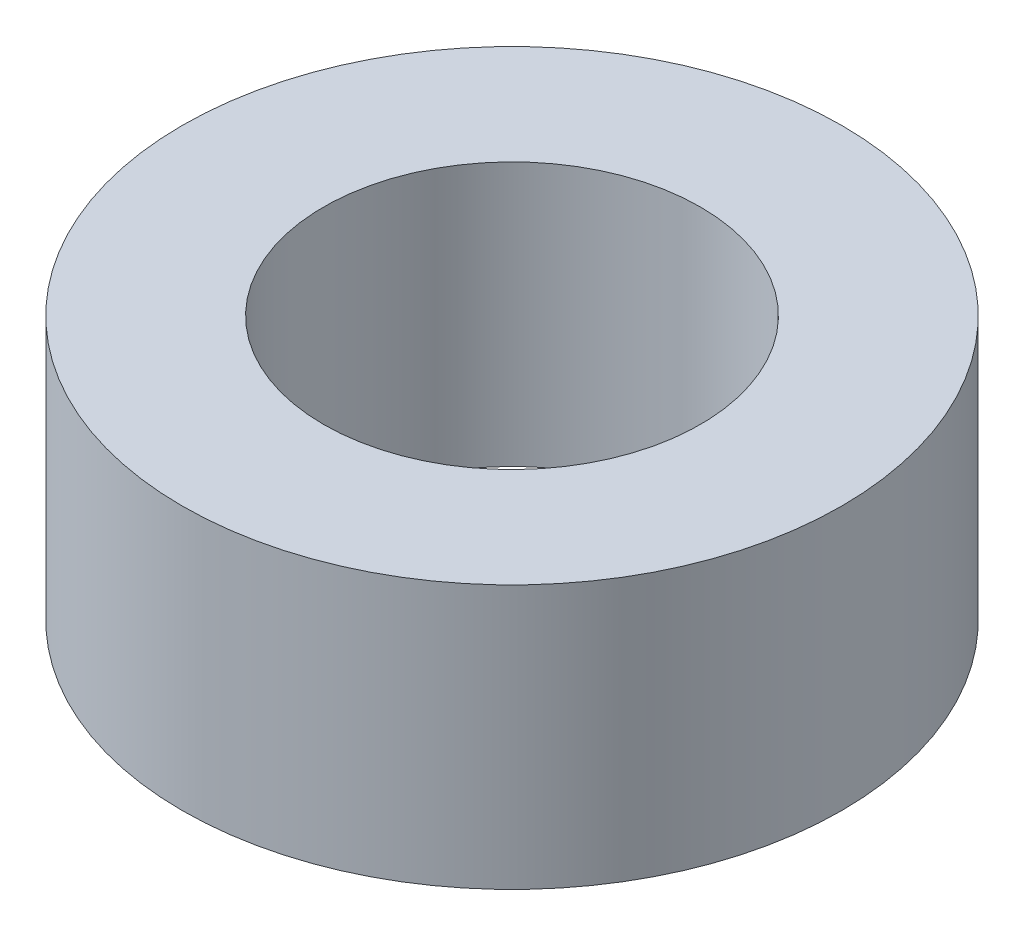
ISO-10303-21;
HEADER;
FILE_DESCRIPTION(('STEP AP214'),'2;1');
FILE_NAME('part.step','',(''),(''),'','','');
FILE_SCHEMA(('AUTOMOTIVE_DESIGN { 1 0 10303 214 1 1 1 1 }'));
ENDSEC;
DATA;
#1=APPLICATION_CONTEXT('core data for automotive mechanical design processes');
#2=APPLICATION_PROTOCOL_DEFINITION('international standard','automotive_design',2000,#1);
#3=PRODUCT_CONTEXT('',#1,'mechanical');
#4=PRODUCT('Part','Part','',(#3));
#5=PRODUCT_RELATED_PRODUCT_CATEGORY('part','',(#4));
#6=PRODUCT_DEFINITION_FORMATION('','',#4);
#7=PRODUCT_DEFINITION_CONTEXT('part definition',#1,'design');
#8=PRODUCT_DEFINITION('design','',#6,#7);
#9=PRODUCT_DEFINITION_SHAPE('','',#8);
#10=(LENGTH_UNIT() NAMED_UNIT(*) SI_UNIT(.MILLI.,.METRE.));
#11=(NAMED_UNIT(*) PLANE_ANGLE_UNIT() SI_UNIT($,.RADIAN.));
#12=(NAMED_UNIT(*) SI_UNIT($,.STERADIAN.) SOLID_ANGLE_UNIT());
#13=UNCERTAINTY_MEASURE_WITH_UNIT(LENGTH_MEASURE(1.E-05),#10,'distance_accuracy_value','');
#14=(GEOMETRIC_REPRESENTATION_CONTEXT(3) GLOBAL_UNCERTAINTY_ASSIGNED_CONTEXT((#13)) GLOBAL_UNIT_ASSIGNED_CONTEXT((#10,
#11,#12)) REPRESENTATION_CONTEXT('',''));
#15=CARTESIAN_POINT('',(0.,0.,0.));
#16=DIRECTION('',(0.,0.,1.));
#17=DIRECTION('',(1.,0.,0.));
#18=AXIS2_PLACEMENT_3D('',#15,#16,#17);
#19=CARTESIAN_POINT('',(0.,14.,0.));
#20=DIRECTION('',(0.,-1.,0.));
#21=DIRECTION('',(0.,0.,-1.));
#22=AXIS2_PLACEMENT_3D('',#19,#20,#21);
#23=CYLINDRICAL_SURFACE('',#22,17.5);
#24=CARTESIAN_POINT('',(0.,14.,0.));
#25=DIRECTION('',(0.,1.,0.));
#26=DIRECTION('',(0.,0.,1.));
#27=AXIS2_PLACEMENT_3D('',#24,#25,#26);
#28=CIRCLE('',#27,17.5);
#29=CARTESIAN_POINT('',(0.,14.,17.5));
#30=VERTEX_POINT('',#29);
#31=EDGE_CURVE('E10',#30,#30,#28,.T.);
#32=ORIENTED_EDGE('',*,*,#31,.F.);
#33=EDGE_LOOP('',(#32));
#34=FACE_BOUND('',#33,.T.);
#35=CARTESIAN_POINT('',(0.,0.,0.));
#36=DIRECTION('',(0.,1.,0.));
#37=DIRECTION('',(0.,0.,1.));
#38=AXIS2_PLACEMENT_3D('',#35,#36,#37);
#39=CIRCLE('',#38,17.5);
#40=CARTESIAN_POINT('',(0.,0.,17.5));
#41=VERTEX_POINT('',#40);
#42=EDGE_CURVE('E37',#41,#41,#39,.T.);
#43=ORIENTED_EDGE('',*,*,#42,.T.);
#44=EDGE_LOOP('',(#43));
#45=FACE_BOUND('',#44,.T.);
#46=ADVANCED_FACE('F40',(#34,#45),#23,.T.);
#47=CARTESIAN_POINT('',(0.,14.,0.));
#48=DIRECTION('',(0.,1.,0.));
#49=DIRECTION('',(0.,0.,1.));
#50=AXIS2_PLACEMENT_3D('',#47,#48,#49);
#51=PLANE('',#50);
#52=CARTESIAN_POINT('',(0.,14.,0.));
#53=DIRECTION('',(0.,1.,0.));
#54=DIRECTION('',(0.,0.,1.));
#55=AXIS2_PLACEMENT_3D('',#52,#53,#54);
#56=CIRCLE('',#55,10.);
#57=CARTESIAN_POINT('',(0.,14.,10.));
#58=VERTEX_POINT('',#57);
#59=EDGE_CURVE('E50',#58,#58,#56,.T.);
#60=ORIENTED_EDGE('',*,*,#59,.F.);
#61=EDGE_LOOP('',(#60));
#62=FACE_BOUND('',#61,.T.);
#63=ORIENTED_EDGE('',*,*,#31,.T.);
#64=EDGE_LOOP('',(#63));
#65=FACE_BOUND('',#64,.T.);
#66=ADVANCED_FACE('F59',(#62,#65),#51,.T.);
#67=CARTESIAN_POINT('',(0.,0.,0.));
#68=DIRECTION('',(0.,1.,0.));
#69=DIRECTION('',(0.,0.,1.));
#70=AXIS2_PLACEMENT_3D('',#67,#68,#69);
#71=PLANE('',#70);
#72=CARTESIAN_POINT('',(0.,0.,0.));
#73=DIRECTION('',(0.,1.,0.));
#74=DIRECTION('',(0.,0.,1.));
#75=AXIS2_PLACEMENT_3D('',#72,#73,#74);
#76=CIRCLE('',#75,10.);
#77=CARTESIAN_POINT('',(0.,0.,10.));
#78=VERTEX_POINT('',#77);
#79=EDGE_CURVE('E47',#78,#78,#76,.T.);
#80=ORIENTED_EDGE('',*,*,#79,.T.);
#81=EDGE_LOOP('',(#80));
#82=FACE_BOUND('',#81,.T.);
#83=ORIENTED_EDGE('',*,*,#42,.F.);
#84=EDGE_LOOP('',(#83));
#85=FACE_BOUND('',#84,.T.);
#86=ADVANCED_FACE('F58',(#82,#85),#71,.F.);
#87=CARTESIAN_POINT('',(0.,14.,0.));
#88=DIRECTION('',(0.,-1.,0.));
#89=DIRECTION('',(0.,0.,-1.));
#90=AXIS2_PLACEMENT_3D('',#87,#88,#89);
#91=CYLINDRICAL_SURFACE('',#90,10.);
#92=ORIENTED_EDGE('',*,*,#59,.T.);
#93=EDGE_LOOP('',(#92));
#94=FACE_BOUND('',#93,.T.);
#95=ORIENTED_EDGE('',*,*,#79,.F.);
#96=EDGE_LOOP('',(#95));
#97=FACE_BOUND('',#96,.T.);
#98=ADVANCED_FACE('F54',(#94,#97),#91,.F.);
#99=CLOSED_SHELL('',(#46,#66,#86,#98));
#100=MANIFOLD_SOLID_BREP('B2',#99);
#101=ADVANCED_BREP_SHAPE_REPRESENTATION('',(#18,#100),#14);
#102=SHAPE_DEFINITION_REPRESENTATION(#9,#101);
ENDSEC;
END-ISO-10303-21;
